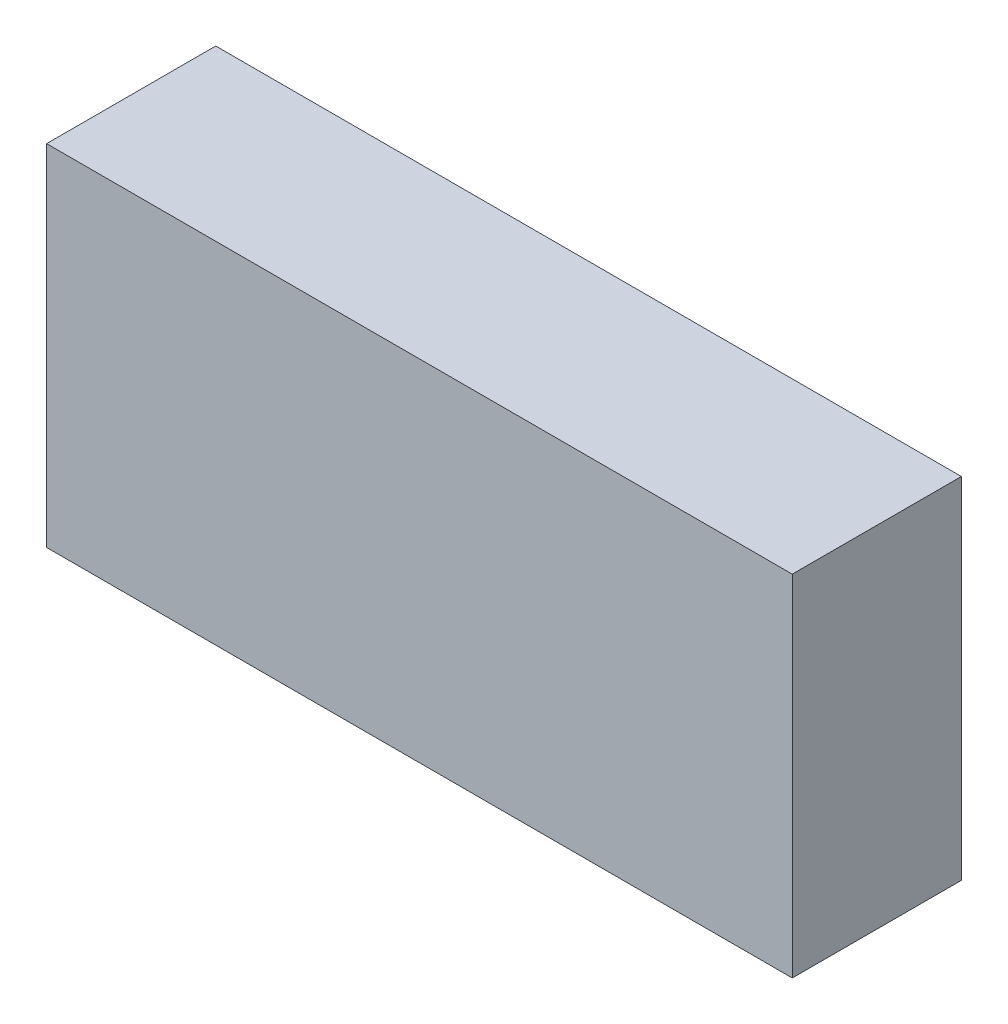
ISO-10303-21;
HEADER;
FILE_DESCRIPTION(('STEP AP214'),'2;1');
FILE_NAME('part.step','',(''),(''),'','','');
FILE_SCHEMA(('AUTOMOTIVE_DESIGN { 1 0 10303 214 1 1 1 1 }'));
ENDSEC;
DATA;
#1=APPLICATION_CONTEXT('core data for automotive mechanical design processes');
#2=APPLICATION_PROTOCOL_DEFINITION('international standard','automotive_design',2000,#1);
#3=PRODUCT_CONTEXT('',#1,'mechanical');
#4=PRODUCT('Part','Part','',(#3));
#5=PRODUCT_RELATED_PRODUCT_CATEGORY('part','',(#4));
#6=PRODUCT_DEFINITION_FORMATION('','',#4);
#7=PRODUCT_DEFINITION_CONTEXT('part definition',#1,'design');
#8=PRODUCT_DEFINITION('design','',#6,#7);
#9=PRODUCT_DEFINITION_SHAPE('','',#8);
#10=(LENGTH_UNIT() NAMED_UNIT(*) SI_UNIT(.MILLI.,.METRE.));
#11=(NAMED_UNIT(*) PLANE_ANGLE_UNIT() SI_UNIT($,.RADIAN.));
#12=(NAMED_UNIT(*) SI_UNIT($,.STERADIAN.) SOLID_ANGLE_UNIT());
#13=UNCERTAINTY_MEASURE_WITH_UNIT(LENGTH_MEASURE(1.E-05),#10,'distance_accuracy_value','');
#14=(GEOMETRIC_REPRESENTATION_CONTEXT(3) GLOBAL_UNCERTAINTY_ASSIGNED_CONTEXT((#13)) GLOBAL_UNIT_ASSIGNED_CONTEXT((#10,
#11,#12)) REPRESENTATION_CONTEXT('',''));
#15=CARTESIAN_POINT('',(0.,0.,0.));
#16=DIRECTION('',(0.,0.,1.));
#17=DIRECTION('',(1.,0.,0.));
#18=AXIS2_PLACEMENT_3D('',#15,#16,#17);
#19=CARTESIAN_POINT('',(97.,-45.5,44.));
#20=DIRECTION('',(-1.,0.,0.));
#21=DIRECTION('',(0.,0.,1.));
#22=AXIS2_PLACEMENT_3D('',#19,#20,#21);
#23=PLANE('',#22);
#24=DIRECTION('',(0.,1.,0.));
#25=VECTOR('',#24,1.);
#26=CARTESIAN_POINT('',(97.,-45.5,0.));
#27=LINE('',#26,#25);
#28=CARTESIAN_POINT('',(97.,-45.5,0.));
#29=VERTEX_POINT('',#28);
#30=CARTESIAN_POINT('',(97.,45.5,0.));
#31=VERTEX_POINT('',#30);
#32=EDGE_CURVE('E98',#29,#31,#27,.T.);
#33=ORIENTED_EDGE('',*,*,#32,.T.);
#34=DIRECTION('',(0.,0.,-1.));
#35=VECTOR('',#34,1.);
#36=CARTESIAN_POINT('',(97.,45.5,44.));
#37=LINE('',#36,#35);
#38=CARTESIAN_POINT('',(97.,45.5,44.));
#39=VERTEX_POINT('',#38);
#40=EDGE_CURVE('E11',#39,#31,#37,.T.);
#41=ORIENTED_EDGE('',*,*,#40,.F.);
#42=DIRECTION('',(0.,1.,0.));
#43=VECTOR('',#42,1.);
#44=CARTESIAN_POINT('',(97.,-45.5,44.));
#45=LINE('',#44,#43);
#46=CARTESIAN_POINT('',(97.,-45.5,44.));
#47=VERTEX_POINT('',#46);
#48=EDGE_CURVE('E86',#47,#39,#45,.T.);
#49=ORIENTED_EDGE('',*,*,#48,.F.);
#50=DIRECTION('',(0.,0.,-1.));
#51=VECTOR('',#50,1.);
#52=CARTESIAN_POINT('',(97.,-45.5,44.));
#53=LINE('',#52,#51);
#54=EDGE_CURVE('E94',#47,#29,#53,.T.);
#55=ORIENTED_EDGE('',*,*,#54,.T.);
#56=EDGE_LOOP('',(#33,#41,#49,#55));
#57=FACE_BOUND('',#56,.T.);
#58=ADVANCED_FACE('F35',(#57),#23,.F.);
#59=CARTESIAN_POINT('',(-97.,45.5,44.));
#60=DIRECTION('',(0.,-1.,0.));
#61=DIRECTION('',(0.,0.,-1.));
#62=AXIS2_PLACEMENT_3D('',#59,#60,#61);
#63=PLANE('',#62);
#64=DIRECTION('',(-1.,0.,0.));
#65=VECTOR('',#64,1.);
#66=CARTESIAN_POINT('',(-97.,45.5,0.));
#67=LINE('',#66,#65);
#68=CARTESIAN_POINT('',(-97.,45.5,0.));
#69=VERTEX_POINT('',#68);
#70=EDGE_CURVE('E90',#31,#69,#67,.T.);
#71=ORIENTED_EDGE('',*,*,#70,.T.);
#72=DIRECTION('',(0.,0.,-1.));
#73=VECTOR('',#72,1.);
#74=CARTESIAN_POINT('',(-97.,45.5,44.));
#75=LINE('',#74,#73);
#76=CARTESIAN_POINT('',(-97.,45.5,44.));
#77=VERTEX_POINT('',#76);
#78=EDGE_CURVE('E43',#77,#69,#75,.T.);
#79=ORIENTED_EDGE('',*,*,#78,.F.);
#80=DIRECTION('',(-1.,0.,0.));
#81=VECTOR('',#80,1.);
#82=CARTESIAN_POINT('',(-97.,45.5,44.));
#83=LINE('',#82,#81);
#84=EDGE_CURVE('E81',#39,#77,#83,.T.);
#85=ORIENTED_EDGE('',*,*,#84,.F.);
#86=ORIENTED_EDGE('',*,*,#40,.T.);
#87=EDGE_LOOP('',(#71,#79,#85,#86));
#88=FACE_BOUND('',#87,.T.);
#89=ADVANCED_FACE('F89',(#88),#63,.F.);
#90=CARTESIAN_POINT('',(-97.,-45.5,44.));
#91=DIRECTION('',(1.,0.,0.));
#92=DIRECTION('',(0.,0.,-1.));
#93=AXIS2_PLACEMENT_3D('',#90,#91,#92);
#94=PLANE('',#93);
#95=DIRECTION('',(0.,-1.,0.));
#96=VECTOR('',#95,1.);
#97=CARTESIAN_POINT('',(-97.,-45.5,0.));
#98=LINE('',#97,#96);
#99=CARTESIAN_POINT('',(-97.,-45.5,0.));
#100=VERTEX_POINT('',#99);
#101=EDGE_CURVE('E68',#69,#100,#98,.T.);
#102=ORIENTED_EDGE('',*,*,#101,.T.);
#103=DIRECTION('',(0.,0.,-1.));
#104=VECTOR('',#103,1.);
#105=CARTESIAN_POINT('',(-97.,-45.5,44.));
#106=LINE('',#105,#104);
#107=CARTESIAN_POINT('',(-97.,-45.5,44.));
#108=VERTEX_POINT('',#107);
#109=EDGE_CURVE('E91',#108,#100,#106,.T.);
#110=ORIENTED_EDGE('',*,*,#109,.F.);
#111=DIRECTION('',(0.,-1.,0.));
#112=VECTOR('',#111,1.);
#113=CARTESIAN_POINT('',(-97.,-45.5,44.));
#114=LINE('',#113,#112);
#115=EDGE_CURVE('E84',#77,#108,#114,.T.);
#116=ORIENTED_EDGE('',*,*,#115,.F.);
#117=ORIENTED_EDGE('',*,*,#78,.T.);
#118=EDGE_LOOP('',(#102,#110,#116,#117));
#119=FACE_BOUND('',#118,.T.);
#120=ADVANCED_FACE('F92',(#119),#94,.F.);
#121=CARTESIAN_POINT('',(-97.,-45.5,44.));
#122=DIRECTION('',(0.,1.,0.));
#123=DIRECTION('',(0.,0.,1.));
#124=AXIS2_PLACEMENT_3D('',#121,#122,#123);
#125=PLANE('',#124);
#126=DIRECTION('',(1.,0.,0.));
#127=VECTOR('',#126,1.);
#128=CARTESIAN_POINT('',(-97.,-45.5,0.));
#129=LINE('',#128,#127);
#130=EDGE_CURVE('E74',#100,#29,#129,.T.);
#131=ORIENTED_EDGE('',*,*,#130,.T.);
#132=ORIENTED_EDGE('',*,*,#54,.F.);
#133=DIRECTION('',(1.,0.,0.));
#134=VECTOR('',#133,1.);
#135=CARTESIAN_POINT('',(-97.,-45.5,44.));
#136=LINE('',#135,#134);
#137=EDGE_CURVE('E51',#108,#47,#136,.T.);
#138=ORIENTED_EDGE('',*,*,#137,.F.);
#139=ORIENTED_EDGE('',*,*,#109,.T.);
#140=EDGE_LOOP('',(#131,#132,#138,#139));
#141=FACE_BOUND('',#140,.T.);
#142=ADVANCED_FACE('F105',(#141),#125,.F.);
#143=CARTESIAN_POINT('',(0.,0.,44.));
#144=DIRECTION('',(0.,0.,-1.));
#145=DIRECTION('',(-1.,0.,0.));
#146=AXIS2_PLACEMENT_3D('',#143,#144,#145);
#147=PLANE('',#146);
#148=ORIENTED_EDGE('',*,*,#48,.T.);
#149=ORIENTED_EDGE('',*,*,#84,.T.);
#150=ORIENTED_EDGE('',*,*,#115,.T.);
#151=ORIENTED_EDGE('',*,*,#137,.T.);
#152=EDGE_LOOP('',(#148,#149,#150,#151));
#153=FACE_BOUND('',#152,.T.);
#154=ADVANCED_FACE('F82',(#153),#147,.F.);
#155=CARTESIAN_POINT('',(0.,0.,0.));
#156=DIRECTION('',(0.,0.,-1.));
#157=DIRECTION('',(-1.,0.,0.));
#158=AXIS2_PLACEMENT_3D('',#155,#156,#157);
#159=PLANE('',#158);
#160=ORIENTED_EDGE('',*,*,#32,.F.);
#161=ORIENTED_EDGE('',*,*,#130,.F.);
#162=ORIENTED_EDGE('',*,*,#101,.F.);
#163=ORIENTED_EDGE('',*,*,#70,.F.);
#164=EDGE_LOOP('',(#160,#161,#162,#163));
#165=FACE_BOUND('',#164,.T.);
#166=ADVANCED_FACE('F108',(#165),#159,.T.);
#167=CLOSED_SHELL('',(#58,#89,#120,#142,#154,#166));
#168=MANIFOLD_SOLID_BREP('B2',#167);
#169=ADVANCED_BREP_SHAPE_REPRESENTATION('',(#18,#168),#14);
#170=SHAPE_DEFINITION_REPRESENTATION(#9,#169);
ENDSEC;
END-ISO-10303-21;
